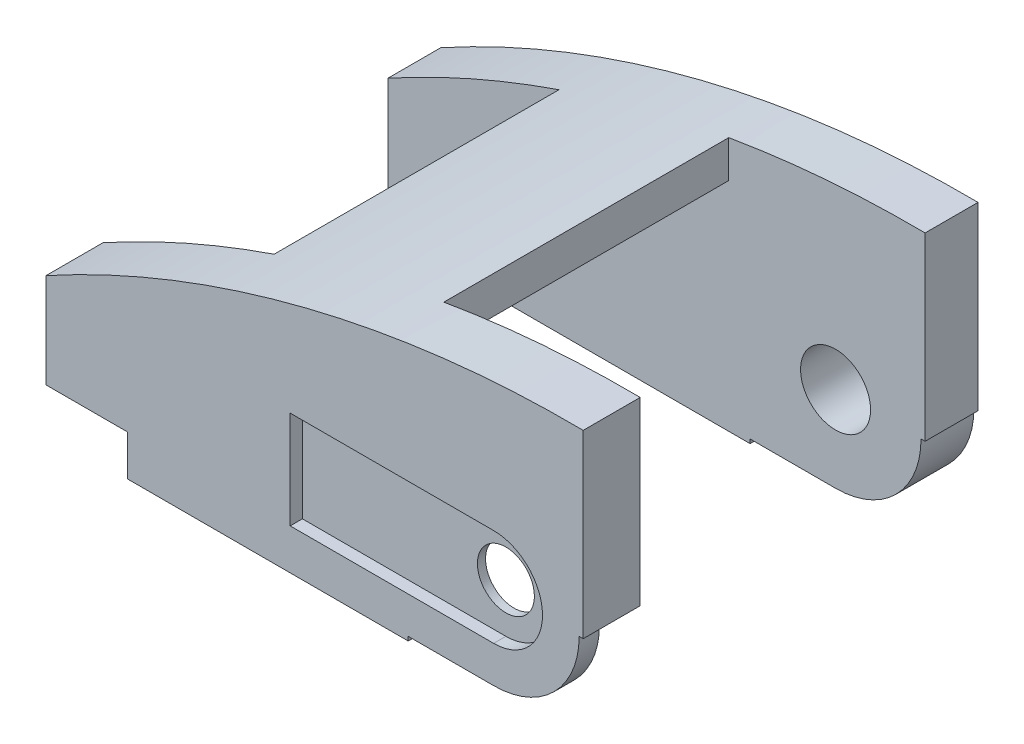
ISO-10303-21;
HEADER;
FILE_DESCRIPTION(('STEP AP214'),'2;1');
FILE_NAME('part.step','',(''),(''),'','','');
FILE_SCHEMA(('AUTOMOTIVE_DESIGN { 1 0 10303 214 1 1 1 1 }'));
ENDSEC;
DATA;
#1=APPLICATION_CONTEXT('core data for automotive mechanical design processes');
#2=APPLICATION_PROTOCOL_DEFINITION('international standard','automotive_design',2000,#1);
#3=PRODUCT_CONTEXT('',#1,'mechanical');
#4=PRODUCT('Part','Part','',(#3));
#5=PRODUCT_RELATED_PRODUCT_CATEGORY('part','',(#4));
#6=PRODUCT_DEFINITION_FORMATION('','',#4);
#7=PRODUCT_DEFINITION_CONTEXT('part definition',#1,'design');
#8=PRODUCT_DEFINITION('design','',#6,#7);
#9=PRODUCT_DEFINITION_SHAPE('','',#8);
#10=(LENGTH_UNIT() NAMED_UNIT(*) SI_UNIT(.MILLI.,.METRE.));
#11=(NAMED_UNIT(*) PLANE_ANGLE_UNIT() SI_UNIT($,.RADIAN.));
#12=(NAMED_UNIT(*) SI_UNIT($,.STERADIAN.) SOLID_ANGLE_UNIT());
#13=UNCERTAINTY_MEASURE_WITH_UNIT(LENGTH_MEASURE(1.E-05),#10,'distance_accuracy_value','');
#14=(GEOMETRIC_REPRESENTATION_CONTEXT(3) GLOBAL_UNCERTAINTY_ASSIGNED_CONTEXT((#13)) GLOBAL_UNIT_ASSIGNED_CONTEXT((#10,
#11,#12)) REPRESENTATION_CONTEXT('',''));
#15=CARTESIAN_POINT('',(0.,0.,0.));
#16=DIRECTION('',(0.,0.,1.));
#17=DIRECTION('',(1.,0.,0.));
#18=AXIS2_PLACEMENT_3D('',#15,#16,#17);
#19=CARTESIAN_POINT('',(0.,0.,0.));
#20=DIRECTION('',(0.,0.,1.));
#21=DIRECTION('',(1.,0.,0.));
#22=AXIS2_PLACEMENT_3D('',#19,#20,#21);
#23=PLANE('',#22);
#24=DIRECTION('',(0.,-1.,0.));
#25=VECTOR('',#24,1.);
#26=CARTESIAN_POINT('',(-10.5,0.,0.));
#27=LINE('',#26,#25);
#28=CARTESIAN_POINT('',(-10.5,-10.5,0.));
#29=VERTEX_POINT('',#28);
#30=CARTESIAN_POINT('',(-10.5,-11.,0.));
#31=VERTEX_POINT('',#30);
#32=EDGE_CURVE('E339',#29,#31,#27,.T.);
#33=ORIENTED_EDGE('',*,*,#32,.F.);
#34=DIRECTION('',(-1.,0.,0.));
#35=VECTOR('',#34,1.);
#36=CARTESIAN_POINT('',(0.,-10.5,0.));
#37=LINE('',#36,#35);
#38=CARTESIAN_POINT('',(1.09981662173559E-13,-10.5,0.));
#39=VERTEX_POINT('',#38);
#40=EDGE_CURVE('E359',#39,#29,#37,.T.);
#41=ORIENTED_EDGE('',*,*,#40,.F.);
#42=CARTESIAN_POINT('',(0.,0.,0.));
#43=DIRECTION('',(0.,0.,1.));
#44=DIRECTION('',(1.,0.,0.));
#45=AXIS2_PLACEMENT_3D('',#42,#43,#44);
#46=CIRCLE('',#45,10.5);
#47=CARTESIAN_POINT('',(10.5,0.,0.));
#48=VERTEX_POINT('',#47);
#49=EDGE_CURVE('E355',#39,#48,#46,.T.);
#50=ORIENTED_EDGE('',*,*,#49,.T.);
#51=DIRECTION('',(1.,0.,0.));
#52=VECTOR('',#51,1.);
#53=CARTESIAN_POINT('',(0.,0.,0.));
#54=LINE('',#53,#52);
#55=CARTESIAN_POINT('',(11.,0.,0.));
#56=VERTEX_POINT('',#55);
#57=EDGE_CURVE('E351',#48,#56,#54,.T.);
#58=ORIENTED_EDGE('',*,*,#57,.T.);
#59=DIRECTION('',(0.,-1.,0.));
#60=VECTOR('',#59,1.);
#61=CARTESIAN_POINT('',(11.,0.,0.));
#62=LINE('',#61,#60);
#63=CARTESIAN_POINT('',(11.,22.17,0.));
#64=VERTEX_POINT('',#63);
#65=EDGE_CURVE('E525',#64,#56,#62,.T.);
#66=ORIENTED_EDGE('',*,*,#65,.F.);
#67=CARTESIAN_POINT('',(9.5633033025968,-112.038627084912,0.));
#68=DIRECTION('',(0.,0.,1.));
#69=DIRECTION('',(1.,0.,0.));
#70=AXIS2_PLACEMENT_3D('',#67,#68,#69);
#71=CIRCLE('',#70,134.216316748067);
#72=CARTESIAN_POINT('',(-55.,5.62869866048854,0.));
#73=VERTEX_POINT('',#72);
#74=EDGE_CURVE('E469',#64,#73,#71,.T.);
#75=ORIENTED_EDGE('',*,*,#74,.T.);
#76=DIRECTION('',(0.,1.,0.));
#77=VECTOR('',#76,1.);
#78=CARTESIAN_POINT('',(-55.,0.,0.));
#79=LINE('',#78,#77);
#80=CARTESIAN_POINT('',(-55.,-6.,0.));
#81=VERTEX_POINT('',#80);
#82=EDGE_CURVE('E504',#81,#73,#79,.T.);
#83=ORIENTED_EDGE('',*,*,#82,.F.);
#84=DIRECTION('',(1.,0.,0.));
#85=VECTOR('',#84,1.);
#86=CARTESIAN_POINT('',(-55.,-6.,0.));
#87=LINE('',#86,#85);
#88=CARTESIAN_POINT('',(-45.,-6.00000000000001,0.));
#89=VERTEX_POINT('',#88);
#90=EDGE_CURVE('E474',#81,#89,#87,.T.);
#91=ORIENTED_EDGE('',*,*,#90,.T.);
#92=DIRECTION('',(0.,-1.,0.));
#93=VECTOR('',#92,1.);
#94=CARTESIAN_POINT('',(-45.,-11.,0.));
#95=LINE('',#94,#93);
#96=CARTESIAN_POINT('',(-45.,-11.,0.));
#97=VERTEX_POINT('',#96);
#98=EDGE_CURVE('E478',#89,#97,#95,.T.);
#99=ORIENTED_EDGE('',*,*,#98,.T.);
#100=DIRECTION('',(-1.,0.,0.));
#101=VECTOR('',#100,1.);
#102=CARTESIAN_POINT('',(0.,-11.,0.));
#103=LINE('',#102,#101);
#104=EDGE_CURVE('E521',#31,#97,#103,.T.);
#105=ORIENTED_EDGE('',*,*,#104,.F.);
#106=EDGE_LOOP('',(#33,#41,#50,#58,#66,#75,#83,#91,#99,#105));
#107=FACE_BOUND('',#106,.T.);
#108=CARTESIAN_POINT('',(0.,0.,0.));
#109=DIRECTION('',(0.,0.,1.));
#110=DIRECTION('',(1.,0.,0.));
#111=AXIS2_PLACEMENT_3D('',#108,#109,#110);
#112=CIRCLE('',#111,6.);
#113=CARTESIAN_POINT('',(0.,-6.,0.));
#114=VERTEX_POINT('',#113);
#115=CARTESIAN_POINT('',(0.,6.,0.));
#116=VERTEX_POINT('',#115);
#117=EDGE_CURVE('E286',#114,#116,#112,.T.);
#118=ORIENTED_EDGE('',*,*,#117,.F.);
#119=DIRECTION('',(-1.,0.,0.));
#120=VECTOR('',#119,1.);
#121=CARTESIAN_POINT('',(0.,-6.,0.));
#122=LINE('',#121,#120);
#123=CARTESIAN_POINT('',(-25.,-6.,0.));
#124=VERTEX_POINT('',#123);
#125=EDGE_CURVE('E65',#114,#124,#122,.T.);
#126=ORIENTED_EDGE('',*,*,#125,.T.);
#127=DIRECTION('',(0.,-1.,0.));
#128=VECTOR('',#127,1.);
#129=CARTESIAN_POINT('',(-25.,0.,0.));
#130=LINE('',#129,#128);
#131=CARTESIAN_POINT('',(-25.,6.,0.));
#132=VERTEX_POINT('',#131);
#133=EDGE_CURVE('E293',#132,#124,#130,.T.);
#134=ORIENTED_EDGE('',*,*,#133,.F.);
#135=DIRECTION('',(-1.,0.,0.));
#136=VECTOR('',#135,1.);
#137=CARTESIAN_POINT('',(0.,6.,0.));
#138=LINE('',#137,#136);
#139=EDGE_CURVE('E289',#116,#132,#138,.T.);
#140=ORIENTED_EDGE('',*,*,#139,.F.);
#141=EDGE_LOOP('',(#118,#126,#134,#140));
#142=FACE_BOUND('',#141,.T.);
#143=ADVANCED_FACE('F47',(#107,#142),#23,.T.);
#144=CARTESIAN_POINT('',(0.,0.,-21.75));
#145=DIRECTION('',(0.,0.,1.));
#146=DIRECTION('',(1.,0.,0.));
#147=AXIS2_PLACEMENT_3D('',#144,#145,#146);
#148=CYLINDRICAL_SURFACE('',#147,3.5);
#149=CARTESIAN_POINT('',(0.,0.,-2.5));
#150=DIRECTION('',(0.,0.,-1.));
#151=DIRECTION('',(0.,1.,0.));
#152=AXIS2_PLACEMENT_3D('',#149,#150,#151);
#153=CIRCLE('',#152,3.5);
#154=CARTESIAN_POINT('',(0.,3.5,-2.5));
#155=VERTEX_POINT('',#154);
#156=EDGE_CURVE('E51',#155,#155,#153,.T.);
#157=ORIENTED_EDGE('',*,*,#156,.T.);
#158=EDGE_LOOP('',(#157));
#159=FACE_BOUND('',#158,.T.);
#160=CARTESIAN_POINT('',(0.,0.,-1.5));
#161=DIRECTION('',(0.,0.,1.));
#162=DIRECTION('',(1.,0.,0.));
#163=AXIS2_PLACEMENT_3D('',#160,#161,#162);
#164=CIRCLE('',#163,3.5);
#165=CARTESIAN_POINT('',(3.5,0.,-1.5));
#166=VERTEX_POINT('',#165);
#167=EDGE_CURVE('E271',#166,#166,#164,.F.);
#168=ORIENTED_EDGE('',*,*,#167,.F.);
#169=EDGE_LOOP('',(#168));
#170=FACE_BOUND('',#169,.T.);
#171=ADVANCED_FACE('F647',(#159,#170),#148,.F.);
#172=CARTESIAN_POINT('',(0.,-10.5,-48.5));
#173=DIRECTION('',(0.,1.,0.));
#174=DIRECTION('',(0.,0.,1.));
#175=AXIS2_PLACEMENT_3D('',#172,#173,#174);
#176=PLANE('',#175);
#177=DIRECTION('',(0.,0.,-1.));
#178=VECTOR('',#177,1.);
#179=CARTESIAN_POINT('',(-9.5,-10.5,-2.5));
#180=LINE('',#179,#178);
#181=CARTESIAN_POINT('',(-9.5,-10.5,-2.5));
#182=VERTEX_POINT('',#181);
#183=CARTESIAN_POINT('',(-9.5,-10.5,-7.00000000000001));
#184=VERTEX_POINT('',#183);
#185=EDGE_CURVE('E316',#182,#184,#180,.T.);
#186=ORIENTED_EDGE('',*,*,#185,.F.);
#187=DIRECTION('',(-1.,0.,0.));
#188=VECTOR('',#187,1.);
#189=CARTESIAN_POINT('',(0.,-10.5,-2.5));
#190=LINE('',#189,#188);
#191=CARTESIAN_POINT('',(1.09981662173559E-13,-10.5,-2.50000000000002));
#192=VERTEX_POINT('',#191);
#193=EDGE_CURVE('E305',#192,#182,#190,.T.);
#194=ORIENTED_EDGE('',*,*,#193,.F.);
#195=DIRECTION('',(0.,0.,1.));
#196=VECTOR('',#195,1.);
#197=CARTESIAN_POINT('',(1.09981662173559E-13,-10.5,-48.5));
#198=LINE('',#197,#196);
#199=EDGE_CURVE('E380',#192,#39,#198,.T.);
#200=ORIENTED_EDGE('',*,*,#199,.T.);
#201=ORIENTED_EDGE('',*,*,#40,.T.);
#202=DIRECTION('',(0.,0.,1.));
#203=VECTOR('',#202,1.);
#204=CARTESIAN_POINT('',(-10.5,-10.5,-48.5));
#205=LINE('',#204,#203);
#206=CARTESIAN_POINT('',(-10.5,-10.5,-7.00000000000001));
#207=VERTEX_POINT('',#206);
#208=EDGE_CURVE('E375',#207,#29,#205,.T.);
#209=ORIENTED_EDGE('',*,*,#208,.F.);
#210=DIRECTION('',(-1.,0.,0.));
#211=VECTOR('',#210,1.);
#212=CARTESIAN_POINT('',(12.,-10.5,-7.));
#213=LINE('',#212,#211);
#214=EDGE_CURVE('E398',#184,#207,#213,.T.);
#215=ORIENTED_EDGE('',*,*,#214,.F.);
#216=EDGE_LOOP('',(#186,#194,#200,#201,#209,#215));
#217=FACE_BOUND('',#216,.T.);
#218=ADVANCED_FACE('F637',(#217),#176,.F.);
#219=CARTESIAN_POINT('',(11.,0.,-48.5));
#220=DIRECTION('',(-1.,0.,0.));
#221=DIRECTION('',(0.,0.,1.));
#222=AXIS2_PLACEMENT_3D('',#219,#220,#221);
#223=PLANE('',#222);
#224=DIRECTION('',(0.,0.,-1.));
#225=VECTOR('',#224,1.);
#226=CARTESIAN_POINT('',(11.,22.17,1.75000000000001));
#227=LINE('',#226,#225);
#228=CARTESIAN_POINT('',(11.,22.17,-42.));
#229=VERTEX_POINT('',#228);
#230=CARTESIAN_POINT('',(11.,22.17,-48.5));
#231=VERTEX_POINT('',#230);
#232=EDGE_CURVE('E460',#229,#231,#227,.T.);
#233=ORIENTED_EDGE('',*,*,#232,.F.);
#234=DIRECTION('',(0.,1.,0.));
#235=VECTOR('',#234,1.);
#236=CARTESIAN_POINT('',(11.,0.,-42.));
#237=LINE('',#236,#235);
#238=CARTESIAN_POINT('',(11.,0.,-42.));
#239=VERTEX_POINT('',#238);
#240=EDGE_CURVE('E508',#239,#229,#237,.T.);
#241=ORIENTED_EDGE('',*,*,#240,.F.);
#242=DIRECTION('',(0.,0.,1.));
#243=VECTOR('',#242,1.);
#244=CARTESIAN_POINT('',(11.,0.,-48.5));
#245=LINE('',#244,#243);
#246=CARTESIAN_POINT('',(11.,0.,-48.5));
#247=VERTEX_POINT('',#246);
#248=EDGE_CURVE('E536',#247,#239,#245,.T.);
#249=ORIENTED_EDGE('',*,*,#248,.F.);
#250=DIRECTION('',(0.,-1.,0.));
#251=VECTOR('',#250,1.);
#252=CARTESIAN_POINT('',(11.,0.,-48.5));
#253=LINE('',#252,#251);
#254=EDGE_CURVE('E528',#231,#247,#253,.T.);
#255=ORIENTED_EDGE('',*,*,#254,.F.);
#256=EDGE_LOOP('',(#233,#241,#249,#255));
#257=FACE_BOUND('',#256,.T.);
#258=ADVANCED_FACE('F624',(#257),#223,.F.);
#259=CARTESIAN_POINT('',(-55.,0.,0.));
#260=DIRECTION('',(-1.,0.,0.));
#261=DIRECTION('',(0.,-1.,0.));
#262=AXIS2_PLACEMENT_3D('',#259,#260,#261);
#263=PLANE('',#262);
#264=DIRECTION('',(0.,0.,-1.));
#265=VECTOR('',#264,1.);
#266=CARTESIAN_POINT('',(-55.,5.62869866048853,1.75000000000001));
#267=LINE('',#266,#265);
#268=CARTESIAN_POINT('',(-55.,5.62869866048854,-7.));
#269=VERTEX_POINT('',#268);
#270=EDGE_CURVE('E561',#73,#269,#267,.T.);
#271=ORIENTED_EDGE('',*,*,#270,.T.);
#272=DIRECTION('',(0.,-1.,0.));
#273=VECTOR('',#272,1.);
#274=CARTESIAN_POINT('',(-55.,0.,-7.));
#275=LINE('',#274,#273);
#276=CARTESIAN_POINT('',(-55.,-6.,-7.));
#277=VERTEX_POINT('',#276);
#278=EDGE_CURVE('E440',#269,#277,#275,.T.);
#279=ORIENTED_EDGE('',*,*,#278,.T.);
#280=DIRECTION('',(0.,0.,-1.));
#281=VECTOR('',#280,1.);
#282=CARTESIAN_POINT('',(-55.,-6.,0.));
#283=LINE('',#282,#281);
#284=EDGE_CURVE('E552',#81,#277,#283,.T.);
#285=ORIENTED_EDGE('',*,*,#284,.F.);
#286=ORIENTED_EDGE('',*,*,#82,.T.);
#287=EDGE_LOOP('',(#271,#279,#285,#286));
#288=FACE_BOUND('',#287,.T.);
#289=ADVANCED_FACE('F708',(#288),#263,.T.);
#290=CARTESIAN_POINT('',(-55.,-6.,0.));
#291=DIRECTION('',(0.,1.,0.));
#292=DIRECTION('',(-1.,0.,0.));
#293=AXIS2_PLACEMENT_3D('',#290,#291,#292);
#294=PLANE('',#293);
#295=DIRECTION('',(-1.,0.,0.));
#296=VECTOR('',#295,1.);
#297=CARTESIAN_POINT('',(-55.,-6.,-7.));
#298=LINE('',#297,#296);
#299=CARTESIAN_POINT('',(-45.,-6.00000000000001,-7.));
#300=VERTEX_POINT('',#299);
#301=EDGE_CURVE('E437',#300,#277,#298,.T.);
#302=ORIENTED_EDGE('',*,*,#301,.F.);
#303=DIRECTION('',(0.,0.,-1.));
#304=VECTOR('',#303,1.);
#305=CARTESIAN_POINT('',(-45.,-6.00000000000001,0.));
#306=LINE('',#305,#304);
#307=EDGE_CURVE('E496',#89,#300,#306,.T.);
#308=ORIENTED_EDGE('',*,*,#307,.F.);
#309=ORIENTED_EDGE('',*,*,#90,.F.);
#310=ORIENTED_EDGE('',*,*,#284,.T.);
#311=EDGE_LOOP('',(#302,#308,#309,#310));
#312=FACE_BOUND('',#311,.T.);
#313=ADVANCED_FACE('F711',(#312),#294,.F.);
#314=CARTESIAN_POINT('',(9.5633033025968,-112.038627084912,1.75000000000001));
#315=DIRECTION('',(0.,0.,-1.));
#316=DIRECTION('',(-1.,0.,0.));
#317=AXIS2_PLACEMENT_3D('',#314,#315,#316);
#318=CYLINDRICAL_SURFACE('',#317,134.216316748067);
#319=DIRECTION('',(0.,0.,-1.));
#320=VECTOR('',#319,1.);
#321=CARTESIAN_POINT('',(-33.9746631160101,14.9198903983571,1.75000000000001));
#322=LINE('',#321,#320);
#323=CARTESIAN_POINT('',(-33.9746631160101,14.9198903983572,-42.));
#324=VERTEX_POINT('',#323);
#325=CARTESIAN_POINT('',(-33.9746631160101,14.9198903983572,-7.));
#326=VERTEX_POINT('',#325);
#327=EDGE_CURVE('E448',#324,#326,#322,.F.);
#328=ORIENTED_EDGE('',*,*,#327,.T.);
#329=CARTESIAN_POINT('',(9.5633033025968,-112.038627084912,-7.));
#330=DIRECTION('',(0.,0.,-1.));
#331=DIRECTION('',(-1.,0.,0.));
#332=AXIS2_PLACEMENT_3D('',#329,#330,#331);
#333=CIRCLE('',#332,134.216316748067);
#334=EDGE_CURVE('E444',#326,#269,#333,.F.);
#335=ORIENTED_EDGE('',*,*,#334,.T.);
#336=ORIENTED_EDGE('',*,*,#270,.F.);
#337=ORIENTED_EDGE('',*,*,#74,.F.);
#338=CARTESIAN_POINT('',(11.,22.17,-7.));
#339=VERTEX_POINT('',#338);
#340=EDGE_CURVE('E461',#64,#339,#227,.T.);
#341=ORIENTED_EDGE('',*,*,#340,.T.);
#342=CARTESIAN_POINT('',(9.5633033025968,-112.038627084912,-7.));
#343=DIRECTION('',(0.,0.,1.));
#344=DIRECTION('',(1.,0.,0.));
#345=AXIS2_PLACEMENT_3D('',#342,#343,#344);
#346=CIRCLE('',#345,134.216316748067);
#347=CARTESIAN_POINT('',(-13.1228451764224,20.2465132317736,-7.));
#348=VERTEX_POINT('',#347);
#349=EDGE_CURVE('E419',#348,#339,#346,.F.);
#350=ORIENTED_EDGE('',*,*,#349,.F.);
#351=DIRECTION('',(0.,0.,-1.));
#352=VECTOR('',#351,1.);
#353=CARTESIAN_POINT('',(-13.1228451764224,20.2465132317736,1.75000000000001));
#354=LINE('',#353,#352);
#355=CARTESIAN_POINT('',(-13.1228451764224,20.2465132317736,-42.));
#356=VERTEX_POINT('',#355);
#357=EDGE_CURVE('E423',#348,#356,#354,.T.);
#358=ORIENTED_EDGE('',*,*,#357,.T.);
#359=CARTESIAN_POINT('',(9.5633033025968,-112.038627084912,-42.));
#360=DIRECTION('',(0.,0.,1.));
#361=DIRECTION('',(1.,0.,0.));
#362=AXIS2_PLACEMENT_3D('',#359,#360,#361);
#363=CIRCLE('',#362,134.216316748067);
#364=EDGE_CURVE('E411',#356,#229,#363,.F.);
#365=ORIENTED_EDGE('',*,*,#364,.T.);
#366=ORIENTED_EDGE('',*,*,#232,.T.);
#367=CARTESIAN_POINT('',(9.5633033025968,-112.038627084912,-48.5));
#368=DIRECTION('',(0.,0.,-1.));
#369=DIRECTION('',(-1.,0.,0.));
#370=AXIS2_PLACEMENT_3D('',#367,#368,#369);
#371=CIRCLE('',#370,134.216316748067);
#372=CARTESIAN_POINT('',(-55.,5.62869866048853,-48.5));
#373=VERTEX_POINT('',#372);
#374=EDGE_CURVE('E465',#373,#231,#371,.T.);
#375=ORIENTED_EDGE('',*,*,#374,.F.);
#376=CARTESIAN_POINT('',(-55.,5.62869866048854,-42.));
#377=VERTEX_POINT('',#376);
#378=EDGE_CURVE('E560',#377,#373,#267,.T.);
#379=ORIENTED_EDGE('',*,*,#378,.F.);
#380=CARTESIAN_POINT('',(9.5633033025968,-112.038627084912,-42.));
#381=DIRECTION('',(0.,0.,-1.));
#382=DIRECTION('',(-1.,0.,0.));
#383=AXIS2_PLACEMENT_3D('',#380,#381,#382);
#384=CIRCLE('',#383,134.216316748067);
#385=EDGE_CURVE('E434',#324,#377,#384,.F.);
#386=ORIENTED_EDGE('',*,*,#385,.F.);
#387=EDGE_LOOP('',(#328,#335,#336,#337,#341,#350,#358,#365,#366,#375,#379,#386));
#388=FACE_BOUND('',#387,.T.);
#389=ADVANCED_FACE('F618',(#388),#318,.T.);
#390=CARTESIAN_POINT('',(-8.45749999999999,-25.4575,-44.25));
#391=DIRECTION('',(0.,0.,1.));
#392=DIRECTION('',(1.,0.,0.));
#393=AXIS2_PLACEMENT_3D('',#390,#391,#392);
#394=CYLINDRICAL_SURFACE('',#393,41.3998624695783);
#395=CARTESIAN_POINT('',(-8.45749999999999,-25.4575,-7.));
#396=DIRECTION('',(0.,0.,1.));
#397=DIRECTION('',(0.,-1.,0.));
#398=AXIS2_PLACEMENT_3D('',#395,#396,#397);
#399=CIRCLE('',#398,41.3998624695783);
#400=CARTESIAN_POINT('',(-33.9746631160101,7.14346622817998,-7.));
#401=VERTEX_POINT('',#400);
#402=CARTESIAN_POINT('',(-13.1228451764224,15.678654011828,-7.));
#403=VERTEX_POINT('',#402);
#404=EDGE_CURVE('E456',#401,#403,#399,.F.);
#405=ORIENTED_EDGE('',*,*,#404,.F.);
#406=DIRECTION('',(0.,0.,1.));
#407=VECTOR('',#406,1.);
#408=CARTESIAN_POINT('',(-33.9746631160101,7.14346622817998,-44.25));
#409=LINE('',#408,#407);
#410=CARTESIAN_POINT('',(-33.9746631160101,7.14346622817998,-42.));
#411=VERTEX_POINT('',#410);
#412=EDGE_CURVE('E569',#401,#411,#409,.F.);
#413=ORIENTED_EDGE('',*,*,#412,.T.);
#414=CARTESIAN_POINT('',(-8.45749999999999,-25.4575,-42.));
#415=DIRECTION('',(0.,0.,1.));
#416=DIRECTION('',(1.,0.,0.));
#417=AXIS2_PLACEMENT_3D('',#414,#415,#416);
#418=CIRCLE('',#417,41.3998624695783);
#419=CARTESIAN_POINT('',(-13.1228451764224,15.678654011828,-42.));
#420=VERTEX_POINT('',#419);
#421=EDGE_CURVE('E452',#411,#420,#418,.F.);
#422=ORIENTED_EDGE('',*,*,#421,.T.);
#423=DIRECTION('',(0.,0.,1.));
#424=VECTOR('',#423,1.);
#425=CARTESIAN_POINT('',(-13.1228451764224,15.678654011828,-44.25));
#426=LINE('',#425,#424);
#427=EDGE_CURVE('E565',#420,#403,#426,.T.);
#428=ORIENTED_EDGE('',*,*,#427,.T.);
#429=EDGE_LOOP('',(#405,#413,#422,#428));
#430=FACE_BOUND('',#429,.T.);
#431=ADVANCED_FACE('F665',(#430),#394,.F.);
#432=CARTESIAN_POINT('',(12.,-12.,-7.));
#433=DIRECTION('',(0.,0.,1.));
#434=DIRECTION('',(0.,-1.,0.));
#435=AXIS2_PLACEMENT_3D('',#432,#433,#434);
#436=PLANE('',#435);
#437=DIRECTION('',(1.,0.,0.));
#438=VECTOR('',#437,1.);
#439=CARTESIAN_POINT('',(12.,0.,-7.));
#440=LINE('',#439,#438);
#441=CARTESIAN_POINT('',(9.5,0.,-7.));
#442=VERTEX_POINT('',#441);
#443=CARTESIAN_POINT('',(11.,0.,-7.00000000000001));
#444=VERTEX_POINT('',#443);
#445=EDGE_CURVE('E388',#442,#444,#440,.T.);
#446=ORIENTED_EDGE('',*,*,#445,.F.);
#447=CARTESIAN_POINT('',(0.,0.,-7.));
#448=DIRECTION('',(0.,0.,-1.));
#449=DIRECTION('',(0.,1.,0.));
#450=AXIS2_PLACEMENT_3D('',#447,#448,#449);
#451=CIRCLE('',#450,9.5);
#452=CARTESIAN_POINT('',(-9.5,0.,-7.));
#453=VERTEX_POINT('',#452);
#454=EDGE_CURVE('E544',#453,#442,#451,.T.);
#455=ORIENTED_EDGE('',*,*,#454,.F.);
#456=DIRECTION('',(0.,1.,0.));
#457=VECTOR('',#456,1.);
#458=CARTESIAN_POINT('',(-9.5,-12.,-7.));
#459=LINE('',#458,#457);
#460=EDGE_CURVE('E327',#184,#453,#459,.T.);
#461=ORIENTED_EDGE('',*,*,#460,.F.);
#462=ORIENTED_EDGE('',*,*,#214,.T.);
#463=DIRECTION('',(0.,-1.,0.));
#464=VECTOR('',#463,1.);
#465=CARTESIAN_POINT('',(-10.5,-12.,-7.));
#466=LINE('',#465,#464);
#467=CARTESIAN_POINT('',(-10.5,-11.,-7.00000000000001));
#468=VERTEX_POINT('',#467);
#469=EDGE_CURVE('E394',#207,#468,#466,.T.);
#470=ORIENTED_EDGE('',*,*,#469,.T.);
#471=DIRECTION('',(-1.,0.,0.));
#472=VECTOR('',#471,1.);
#473=CARTESIAN_POINT('',(0.,-11.,-7.));
#474=LINE('',#473,#472);
#475=CARTESIAN_POINT('',(-45.,-11.,-6.99999999999999));
#476=VERTEX_POINT('',#475);
#477=EDGE_CURVE('E522',#468,#476,#474,.T.);
#478=ORIENTED_EDGE('',*,*,#477,.T.);
#479=DIRECTION('',(0.,1.,0.));
#480=VECTOR('',#479,1.);
#481=CARTESIAN_POINT('',(-45.,-12.,-7.));
#482=LINE('',#481,#480);
#483=EDGE_CURVE('E494',#476,#300,#482,.T.);
#484=ORIENTED_EDGE('',*,*,#483,.T.);
#485=ORIENTED_EDGE('',*,*,#301,.T.);
#486=ORIENTED_EDGE('',*,*,#278,.F.);
#487=ORIENTED_EDGE('',*,*,#334,.F.);
#488=DIRECTION('',(0.,1.,0.));
#489=VECTOR('',#488,1.);
#490=CARTESIAN_POINT('',(-33.9746631160101,19.6003459082393,-7.));
#491=LINE('',#490,#489);
#492=EDGE_CURVE('E406',#401,#326,#491,.T.);
#493=ORIENTED_EDGE('',*,*,#492,.F.);
#494=ORIENTED_EDGE('',*,*,#404,.T.);
#495=DIRECTION('',(0.,-1.,0.));
#496=VECTOR('',#495,1.);
#497=CARTESIAN_POINT('',(-13.1228451764224,24.9751933895616,-7.));
#498=LINE('',#497,#496);
#499=EDGE_CURVE('E401',#348,#403,#498,.T.);
#500=ORIENTED_EDGE('',*,*,#499,.F.);
#501=ORIENTED_EDGE('',*,*,#349,.T.);
#502=DIRECTION('',(0.,-1.,0.));
#503=VECTOR('',#502,1.);
#504=CARTESIAN_POINT('',(11.,-12.,-7.));
#505=LINE('',#504,#503);
#506=EDGE_CURVE('E539',#339,#444,#505,.T.);
#507=ORIENTED_EDGE('',*,*,#506,.T.);
#508=EDGE_LOOP('',(#446,#455,#461,#462,#470,#478,#484,#485,#486,#487,#493,#494,#500,#501,#507));
#509=FACE_BOUND('',#508,.T.);
#510=ADVANCED_FACE('F663',(#509),#436,.F.);
#511=CARTESIAN_POINT('',(0.,0.,-48.5));
#512=DIRECTION('',(0.,0.,-1.));
#513=DIRECTION('',(-1.,0.,0.));
#514=AXIS2_PLACEMENT_3D('',#511,#512,#513);
#515=PLANE('',#514);
#516=CARTESIAN_POINT('',(0.,0.,-48.5));
#517=DIRECTION('',(0.,0.,1.));
#518=DIRECTION('',(1.,0.,0.));
#519=AXIS2_PLACEMENT_3D('',#516,#517,#518);
#520=CIRCLE('',#519,4.3);
#521=CARTESIAN_POINT('',(4.3,0.,-48.5));
#522=VERTEX_POINT('',#521);
#523=EDGE_CURVE('E330',#522,#522,#520,.T.);
#524=ORIENTED_EDGE('',*,*,#523,.T.);
#525=EDGE_LOOP('',(#524));
#526=FACE_BOUND('',#525,.T.);
#527=DIRECTION('',(0.,-1.,0.));
#528=VECTOR('',#527,1.);
#529=CARTESIAN_POINT('',(-10.5,0.,-48.5));
#530=LINE('',#529,#528);
#531=CARTESIAN_POINT('',(-10.5,-10.5,-48.5));
#532=VERTEX_POINT('',#531);
#533=CARTESIAN_POINT('',(-10.5,-11.,-48.5));
#534=VERTEX_POINT('',#533);
#535=EDGE_CURVE('E346',#532,#534,#530,.T.);
#536=ORIENTED_EDGE('',*,*,#535,.T.);
#537=DIRECTION('',(-1.,0.,0.));
#538=VECTOR('',#537,1.);
#539=CARTESIAN_POINT('',(0.,-11.,-48.5));
#540=LINE('',#539,#538);
#541=CARTESIAN_POINT('',(-45.,-11.,-48.5));
#542=VERTEX_POINT('',#541);
#543=EDGE_CURVE('E518',#534,#542,#540,.T.);
#544=ORIENTED_EDGE('',*,*,#543,.T.);
#545=DIRECTION('',(0.,-1.,0.));
#546=VECTOR('',#545,1.);
#547=CARTESIAN_POINT('',(-45.,-11.,-48.5));
#548=LINE('',#547,#546);
#549=CARTESIAN_POINT('',(-45.,-6.00000000000001,-48.5));
#550=VERTEX_POINT('',#549);
#551=EDGE_CURVE('E479',#550,#542,#548,.T.);
#552=ORIENTED_EDGE('',*,*,#551,.F.);
#553=DIRECTION('',(1.,0.,0.));
#554=VECTOR('',#553,1.);
#555=CARTESIAN_POINT('',(-55.,-6.,-48.5));
#556=LINE('',#555,#554);
#557=CARTESIAN_POINT('',(-55.,-6.,-48.5));
#558=VERTEX_POINT('',#557);
#559=EDGE_CURVE('E473',#558,#550,#556,.T.);
#560=ORIENTED_EDGE('',*,*,#559,.F.);
#561=DIRECTION('',(0.,1.,0.));
#562=VECTOR('',#561,1.);
#563=CARTESIAN_POINT('',(-55.,0.,-48.5));
#564=LINE('',#563,#562);
#565=EDGE_CURVE('E503',#558,#373,#564,.T.);
#566=ORIENTED_EDGE('',*,*,#565,.T.);
#567=ORIENTED_EDGE('',*,*,#374,.T.);
#568=ORIENTED_EDGE('',*,*,#254,.T.);
#569=DIRECTION('',(1.,0.,0.));
#570=VECTOR('',#569,1.);
#571=CARTESIAN_POINT('',(0.,0.,-48.5));
#572=LINE('',#571,#570);
#573=CARTESIAN_POINT('',(10.5,0.,-48.5));
#574=VERTEX_POINT('',#573);
#575=EDGE_CURVE('E335',#574,#247,#572,.T.);
#576=ORIENTED_EDGE('',*,*,#575,.F.);
#577=CARTESIAN_POINT('',(0.,0.,-48.5));
#578=DIRECTION('',(0.,0.,1.));
#579=DIRECTION('',(1.,0.,0.));
#580=AXIS2_PLACEMENT_3D('',#577,#578,#579);
#581=CIRCLE('',#580,10.5);
#582=CARTESIAN_POINT('',(1.09981662173559E-13,-10.5,-48.5));
#583=VERTEX_POINT('',#582);
#584=EDGE_CURVE('E338',#583,#574,#581,.T.);
#585=ORIENTED_EDGE('',*,*,#584,.F.);
#586=DIRECTION('',(-1.,0.,0.));
#587=VECTOR('',#586,1.);
#588=CARTESIAN_POINT('',(0.,-10.5,-48.5));
#589=LINE('',#588,#587);
#590=EDGE_CURVE('E342',#583,#532,#589,.T.);
#591=ORIENTED_EDGE('',*,*,#590,.T.);
#592=EDGE_LOOP('',(#536,#544,#552,#560,#566,#567,#568,#576,#585,#591));
#593=FACE_BOUND('',#592,.T.);
#594=ADVANCED_FACE('F586',(#526,#593),#515,.T.);
#595=CARTESIAN_POINT('',(0.,0.,-42.));
#596=DIRECTION('',(0.,0.,1.));
#597=DIRECTION('',(1.,0.,0.));
#598=AXIS2_PLACEMENT_3D('',#595,#596,#597);
#599=PLANE('',#598);
#600=CARTESIAN_POINT('',(0.,0.,-42.));
#601=DIRECTION('',(0.,0.,1.));
#602=DIRECTION('',(1.,0.,0.));
#603=AXIS2_PLACEMENT_3D('',#600,#601,#602);
#604=CIRCLE('',#603,4.3);
#605=CARTESIAN_POINT('',(4.3,0.,-42.));
#606=VERTEX_POINT('',#605);
#607=EDGE_CURVE('E334',#606,#606,#604,.T.);
#608=ORIENTED_EDGE('',*,*,#607,.F.);
#609=EDGE_LOOP('',(#608));
#610=FACE_BOUND('',#609,.T.);
#611=DIRECTION('',(0.,-1.,0.));
#612=VECTOR('',#611,1.);
#613=CARTESIAN_POINT('',(-10.5,0.,-42.));
#614=LINE('',#613,#612);
#615=CARTESIAN_POINT('',(-10.5,-10.5,-42.));
#616=VERTEX_POINT('',#615);
#617=CARTESIAN_POINT('',(-10.5,-11.,-42.));
#618=VERTEX_POINT('',#617);
#619=EDGE_CURVE('E391',#616,#618,#614,.T.);
#620=ORIENTED_EDGE('',*,*,#619,.F.);
#621=DIRECTION('',(-1.,0.,0.));
#622=VECTOR('',#621,1.);
#623=CARTESIAN_POINT('',(0.,-10.5,-42.));
#624=LINE('',#623,#622);
#625=CARTESIAN_POINT('',(1.09981662173559E-13,-10.5,-42.));
#626=VERTEX_POINT('',#625);
#627=EDGE_CURVE('E11',#626,#616,#624,.T.);
#628=ORIENTED_EDGE('',*,*,#627,.F.);
#629=CARTESIAN_POINT('',(0.,0.,-42.));
#630=DIRECTION('',(0.,0.,1.));
#631=DIRECTION('',(1.,0.,0.));
#632=AXIS2_PLACEMENT_3D('',#629,#630,#631);
#633=CIRCLE('',#632,10.5);
#634=CARTESIAN_POINT('',(10.5,0.,-42.));
#635=VERTEX_POINT('',#634);
#636=EDGE_CURVE('E57',#626,#635,#633,.T.);
#637=ORIENTED_EDGE('',*,*,#636,.T.);
#638=DIRECTION('',(1.,0.,0.));
#639=VECTOR('',#638,1.);
#640=CARTESIAN_POINT('',(0.,0.,-42.));
#641=LINE('',#640,#639);
#642=EDGE_CURVE('E369',#635,#239,#641,.T.);
#643=ORIENTED_EDGE('',*,*,#642,.T.);
#644=ORIENTED_EDGE('',*,*,#240,.T.);
#645=ORIENTED_EDGE('',*,*,#364,.F.);
#646=DIRECTION('',(0.,-1.,0.));
#647=VECTOR('',#646,1.);
#648=CARTESIAN_POINT('',(-13.1228451764224,24.9751933895616,-42.));
#649=LINE('',#648,#647);
#650=EDGE_CURVE('E407',#356,#420,#649,.T.);
#651=ORIENTED_EDGE('',*,*,#650,.T.);
#652=ORIENTED_EDGE('',*,*,#421,.F.);
#653=DIRECTION('',(0.,1.,0.));
#654=VECTOR('',#653,1.);
#655=CARTESIAN_POINT('',(-33.9746631160101,19.6003459082393,-42.));
#656=LINE('',#655,#654);
#657=EDGE_CURVE('E402',#411,#324,#656,.T.);
#658=ORIENTED_EDGE('',*,*,#657,.T.);
#659=ORIENTED_EDGE('',*,*,#385,.T.);
#660=DIRECTION('',(0.,-1.,0.));
#661=VECTOR('',#660,1.);
#662=CARTESIAN_POINT('',(-55.,0.,-42.));
#663=LINE('',#662,#661);
#664=CARTESIAN_POINT('',(-55.,-6.,-42.));
#665=VERTEX_POINT('',#664);
#666=EDGE_CURVE('E431',#377,#665,#663,.T.);
#667=ORIENTED_EDGE('',*,*,#666,.T.);
#668=DIRECTION('',(-1.,0.,0.));
#669=VECTOR('',#668,1.);
#670=CARTESIAN_POINT('',(-55.,-6.,-42.));
#671=LINE('',#670,#669);
#672=CARTESIAN_POINT('',(-45.,-6.00000000000001,-42.));
#673=VERTEX_POINT('',#672);
#674=EDGE_CURVE('E427',#673,#665,#671,.T.);
#675=ORIENTED_EDGE('',*,*,#674,.F.);
#676=DIRECTION('',(0.,1.,0.));
#677=VECTOR('',#676,1.);
#678=CARTESIAN_POINT('',(-45.,0.,-42.));
#679=LINE('',#678,#677);
#680=CARTESIAN_POINT('',(-45.,-11.,-42.));
#681=VERTEX_POINT('',#680);
#682=EDGE_CURVE('E556',#681,#673,#679,.T.);
#683=ORIENTED_EDGE('',*,*,#682,.F.);
#684=DIRECTION('',(1.,0.,0.));
#685=VECTOR('',#684,1.);
#686=CARTESIAN_POINT('',(0.,-11.,-42.));
#687=LINE('',#686,#685);
#688=EDGE_CURVE('E514',#681,#618,#687,.T.);
#689=ORIENTED_EDGE('',*,*,#688,.T.);
#690=EDGE_LOOP('',(#620,#628,#637,#643,#644,#645,#651,#652,#658,#659,#667,#675,#683,#689));
#691=FACE_BOUND('',#690,.T.);
#692=ADVANCED_FACE('F582',(#610,#691),#599,.T.);
#693=ORIENTED_EDGE('',*,*,#506,.F.);
#694=ORIENTED_EDGE('',*,*,#340,.F.);
#695=ORIENTED_EDGE('',*,*,#65,.T.);
#696=EDGE_CURVE('E532',#444,#56,#245,.T.);
#697=ORIENTED_EDGE('',*,*,#696,.F.);
#698=EDGE_LOOP('',(#693,#694,#695,#697));
#699=FACE_BOUND('',#698,.T.);
#700=ADVANCED_FACE('F585',(#699),#223,.F.);
#701=ORIENTED_EDGE('',*,*,#666,.F.);
#702=ORIENTED_EDGE('',*,*,#378,.T.);
#703=ORIENTED_EDGE('',*,*,#565,.F.);
#704=EDGE_CURVE('E548',#665,#558,#283,.T.);
#705=ORIENTED_EDGE('',*,*,#704,.F.);
#706=EDGE_LOOP('',(#701,#702,#703,#705));
#707=FACE_BOUND('',#706,.T.);
#708=ADVANCED_FACE('F612',(#707),#263,.T.);
#709=CARTESIAN_POINT('',(0.,-11.,-7.));
#710=DIRECTION('',(0.,1.,0.));
#711=DIRECTION('',(-1.,0.,0.));
#712=AXIS2_PLACEMENT_3D('',#709,#710,#711);
#713=PLANE('',#712);
#714=ORIENTED_EDGE('',*,*,#543,.F.);
#715=DIRECTION('',(0.,0.,1.));
#716=VECTOR('',#715,1.);
#717=CARTESIAN_POINT('',(-10.5,-11.,-48.5));
#718=LINE('',#717,#716);
#719=EDGE_CURVE('E365',#534,#618,#718,.T.);
#720=ORIENTED_EDGE('',*,*,#719,.T.);
#721=ORIENTED_EDGE('',*,*,#688,.F.);
#722=DIRECTION('',(0.,0.,-1.));
#723=VECTOR('',#722,1.);
#724=CARTESIAN_POINT('',(-45.,-11.,0.));
#725=LINE('',#724,#723);
#726=EDGE_CURVE('E495',#681,#542,#725,.T.);
#727=ORIENTED_EDGE('',*,*,#726,.T.);
#728=EDGE_LOOP('',(#714,#720,#721,#727));
#729=FACE_BOUND('',#728,.T.);
#730=ADVANCED_FACE('F597',(#729),#713,.F.);
#731=ORIENTED_EDGE('',*,*,#477,.F.);
#732=EDGE_CURVE('E370',#468,#31,#718,.T.);
#733=ORIENTED_EDGE('',*,*,#732,.T.);
#734=ORIENTED_EDGE('',*,*,#104,.T.);
#735=EDGE_CURVE('E490',#97,#476,#725,.T.);
#736=ORIENTED_EDGE('',*,*,#735,.T.);
#737=EDGE_LOOP('',(#731,#733,#734,#736));
#738=FACE_BOUND('',#737,.T.);
#739=ADVANCED_FACE('F676',(#738),#713,.F.);
#740=CARTESIAN_POINT('',(0.,0.,-2.5));
#741=DIRECTION('',(0.,0.,-1.));
#742=DIRECTION('',(0.,1.,0.));
#743=AXIS2_PLACEMENT_3D('',#740,#741,#742);
#744=PLANE('',#743);
#745=ORIENTED_EDGE('',*,*,#156,.F.);
#746=EDGE_LOOP('',(#745));
#747=FACE_BOUND('',#746,.T.);
#748=CARTESIAN_POINT('',(0.,0.,-2.5));
#749=DIRECTION('',(0.,0.,-1.));
#750=DIRECTION('',(0.,1.,0.));
#751=AXIS2_PLACEMENT_3D('',#748,#749,#750);
#752=CIRCLE('',#751,9.5);
#753=CARTESIAN_POINT('',(-9.5,0.,-2.5));
#754=VERTEX_POINT('',#753);
#755=CARTESIAN_POINT('',(9.5,0.,-2.5));
#756=VERTEX_POINT('',#755);
#757=EDGE_CURVE('E543',#754,#756,#752,.T.);
#758=ORIENTED_EDGE('',*,*,#757,.T.);
#759=DIRECTION('',(1.,0.,0.));
#760=VECTOR('',#759,1.);
#761=CARTESIAN_POINT('',(0.,0.,-2.5));
#762=LINE('',#761,#760);
#763=CARTESIAN_POINT('',(10.5,0.,-2.5));
#764=VERTEX_POINT('',#763);
#765=EDGE_CURVE('E310',#756,#764,#762,.T.);
#766=ORIENTED_EDGE('',*,*,#765,.T.);
#767=CARTESIAN_POINT('',(0.,0.,-2.5));
#768=DIRECTION('',(0.,0.,1.));
#769=DIRECTION('',(1.,0.,0.));
#770=AXIS2_PLACEMENT_3D('',#767,#768,#769);
#771=CIRCLE('',#770,10.5);
#772=EDGE_CURVE('E73',#192,#764,#771,.T.);
#773=ORIENTED_EDGE('',*,*,#772,.F.);
#774=ORIENTED_EDGE('',*,*,#193,.T.);
#775=DIRECTION('',(0.,-1.,0.));
#776=VECTOR('',#775,1.);
#777=CARTESIAN_POINT('',(-9.5,0.,-2.5));
#778=LINE('',#777,#776);
#779=EDGE_CURVE('E313',#754,#182,#778,.T.);
#780=ORIENTED_EDGE('',*,*,#779,.F.);
#781=EDGE_LOOP('',(#758,#766,#773,#774,#780));
#782=FACE_BOUND('',#781,.T.);
#783=ADVANCED_FACE('F49',(#747,#782),#744,.T.);
#784=CARTESIAN_POINT('',(0.,0.,-2.5));
#785=DIRECTION('',(0.,0.,-1.));
#786=DIRECTION('',(0.,1.,0.));
#787=AXIS2_PLACEMENT_3D('',#784,#785,#786);
#788=CYLINDRICAL_SURFACE('',#787,9.5);
#789=ORIENTED_EDGE('',*,*,#454,.T.);
#790=DIRECTION('',(0.,0.,-1.));
#791=VECTOR('',#790,1.);
#792=CARTESIAN_POINT('',(9.5,0.,-2.5));
#793=LINE('',#792,#791);
#794=EDGE_CURVE('E323',#756,#442,#793,.T.);
#795=ORIENTED_EDGE('',*,*,#794,.F.);
#796=ORIENTED_EDGE('',*,*,#757,.F.);
#797=DIRECTION('',(0.,0.,-1.));
#798=VECTOR('',#797,1.);
#799=CARTESIAN_POINT('',(-9.5,0.,-2.5));
#800=LINE('',#799,#798);
#801=EDGE_CURVE('E319',#754,#453,#800,.T.);
#802=ORIENTED_EDGE('',*,*,#801,.T.);
#803=EDGE_LOOP('',(#789,#795,#796,#802));
#804=FACE_BOUND('',#803,.T.);
#805=ADVANCED_FACE('F667',(#804),#788,.F.);
#806=CARTESIAN_POINT('',(-45.,-11.,0.));
#807=DIRECTION('',(1.,0.,0.));
#808=DIRECTION('',(0.,0.,-1.));
#809=AXIS2_PLACEMENT_3D('',#806,#807,#808);
#810=PLANE('',#809);
#811=ORIENTED_EDGE('',*,*,#682,.T.);
#812=EDGE_CURVE('E483',#673,#550,#306,.T.);
#813=ORIENTED_EDGE('',*,*,#812,.T.);
#814=ORIENTED_EDGE('',*,*,#551,.T.);
#815=ORIENTED_EDGE('',*,*,#726,.F.);
#816=EDGE_LOOP('',(#811,#813,#814,#815));
#817=FACE_BOUND('',#816,.T.);
#818=ADVANCED_FACE('F603',(#817),#810,.F.);
#819=ORIENTED_EDGE('',*,*,#735,.F.);
#820=ORIENTED_EDGE('',*,*,#98,.F.);
#821=ORIENTED_EDGE('',*,*,#307,.T.);
#822=ORIENTED_EDGE('',*,*,#483,.F.);
#823=EDGE_LOOP('',(#819,#820,#821,#822));
#824=FACE_BOUND('',#823,.T.);
#825=ADVANCED_FACE('F674',(#824),#810,.F.);
#826=ORIENTED_EDGE('',*,*,#812,.F.);
#827=ORIENTED_EDGE('',*,*,#674,.T.);
#828=ORIENTED_EDGE('',*,*,#704,.T.);
#829=ORIENTED_EDGE('',*,*,#559,.T.);
#830=EDGE_LOOP('',(#826,#827,#828,#829));
#831=FACE_BOUND('',#830,.T.);
#832=ADVANCED_FACE('F607',(#831),#294,.F.);
#833=CARTESIAN_POINT('',(-13.1228451764224,24.9751933895616,-7.));
#834=DIRECTION('',(1.,0.,0.));
#835=DIRECTION('',(0.,0.,-1.));
#836=AXIS2_PLACEMENT_3D('',#833,#834,#835);
#837=PLANE('',#836);
#838=ORIENTED_EDGE('',*,*,#499,.T.);
#839=ORIENTED_EDGE('',*,*,#427,.F.);
#840=ORIENTED_EDGE('',*,*,#650,.F.);
#841=ORIENTED_EDGE('',*,*,#357,.F.);
#842=EDGE_LOOP('',(#838,#839,#840,#841));
#843=FACE_BOUND('',#842,.T.);
#844=ADVANCED_FACE('F879',(#843),#837,.T.);
#845=CARTESIAN_POINT('',(-33.9746631160101,19.6003459082393,-7.));
#846=DIRECTION('',(-1.,0.,0.));
#847=DIRECTION('',(0.,0.,1.));
#848=AXIS2_PLACEMENT_3D('',#845,#846,#847);
#849=PLANE('',#848);
#850=ORIENTED_EDGE('',*,*,#657,.F.);
#851=ORIENTED_EDGE('',*,*,#412,.F.);
#852=ORIENTED_EDGE('',*,*,#492,.T.);
#853=ORIENTED_EDGE('',*,*,#327,.F.);
#854=EDGE_LOOP('',(#850,#851,#852,#853));
#855=FACE_BOUND('',#854,.T.);
#856=ADVANCED_FACE('F871',(#855),#849,.T.);
#857=CARTESIAN_POINT('',(-10.5,0.,-48.5));
#858=DIRECTION('',(-1.,0.,0.));
#859=DIRECTION('',(0.,0.,1.));
#860=AXIS2_PLACEMENT_3D('',#857,#858,#859);
#861=PLANE('',#860);
#862=ORIENTED_EDGE('',*,*,#208,.T.);
#863=ORIENTED_EDGE('',*,*,#32,.T.);
#864=ORIENTED_EDGE('',*,*,#732,.F.);
#865=ORIENTED_EDGE('',*,*,#469,.F.);
#866=EDGE_LOOP('',(#862,#863,#864,#865));
#867=FACE_BOUND('',#866,.T.);
#868=ADVANCED_FACE('F645',(#867),#861,.F.);
#869=CARTESIAN_POINT('',(0.,0.,-48.5));
#870=DIRECTION('',(0.,-1.,0.));
#871=DIRECTION('',(0.,0.,-1.));
#872=AXIS2_PLACEMENT_3D('',#869,#870,#871);
#873=PLANE('',#872);
#874=ORIENTED_EDGE('',*,*,#445,.T.);
#875=ORIENTED_EDGE('',*,*,#696,.T.);
#876=ORIENTED_EDGE('',*,*,#57,.F.);
#877=DIRECTION('',(0.,0.,1.));
#878=VECTOR('',#877,1.);
#879=CARTESIAN_POINT('',(10.5,0.,-48.5));
#880=LINE('',#879,#878);
#881=EDGE_CURVE('E350',#764,#48,#880,.T.);
#882=ORIENTED_EDGE('',*,*,#881,.F.);
#883=ORIENTED_EDGE('',*,*,#765,.F.);
#884=ORIENTED_EDGE('',*,*,#794,.T.);
#885=EDGE_LOOP('',(#874,#875,#876,#882,#883,#884));
#886=FACE_BOUND('',#885,.T.);
#887=ADVANCED_FACE('F685',(#886),#873,.T.);
#888=CARTESIAN_POINT('',(0.,0.,-48.5));
#889=DIRECTION('',(0.,0.,1.));
#890=DIRECTION('',(1.,0.,0.));
#891=AXIS2_PLACEMENT_3D('',#888,#889,#890);
#892=CYLINDRICAL_SURFACE('',#891,10.5);
#893=ORIENTED_EDGE('',*,*,#772,.T.);
#894=ORIENTED_EDGE('',*,*,#881,.T.);
#895=ORIENTED_EDGE('',*,*,#49,.F.);
#896=ORIENTED_EDGE('',*,*,#199,.F.);
#897=EDGE_LOOP('',(#893,#894,#895,#896));
#898=FACE_BOUND('',#897,.T.);
#899=ADVANCED_FACE('F643',(#898),#892,.T.);
#900=ORIENTED_EDGE('',*,*,#619,.T.);
#901=ORIENTED_EDGE('',*,*,#719,.F.);
#902=ORIENTED_EDGE('',*,*,#535,.F.);
#903=EDGE_CURVE('E371',#532,#616,#205,.T.);
#904=ORIENTED_EDGE('',*,*,#903,.T.);
#905=EDGE_LOOP('',(#900,#901,#902,#904));
#906=FACE_BOUND('',#905,.T.);
#907=ADVANCED_FACE('F593',(#906),#861,.F.);
#908=ORIENTED_EDGE('',*,*,#627,.T.);
#909=ORIENTED_EDGE('',*,*,#903,.F.);
#910=ORIENTED_EDGE('',*,*,#590,.F.);
#911=EDGE_CURVE('E376',#583,#626,#198,.T.);
#912=ORIENTED_EDGE('',*,*,#911,.T.);
#913=EDGE_LOOP('',(#908,#909,#910,#912));
#914=FACE_BOUND('',#913,.T.);
#915=ADVANCED_FACE('F633',(#914),#176,.F.);
#916=ORIENTED_EDGE('',*,*,#911,.F.);
#917=ORIENTED_EDGE('',*,*,#584,.T.);
#918=EDGE_CURVE('E381',#574,#635,#880,.T.);
#919=ORIENTED_EDGE('',*,*,#918,.T.);
#920=ORIENTED_EDGE('',*,*,#636,.F.);
#921=EDGE_LOOP('',(#916,#917,#919,#920));
#922=FACE_BOUND('',#921,.T.);
#923=ADVANCED_FACE('F630',(#922),#892,.T.);
#924=ORIENTED_EDGE('',*,*,#918,.F.);
#925=ORIENTED_EDGE('',*,*,#575,.T.);
#926=ORIENTED_EDGE('',*,*,#248,.T.);
#927=ORIENTED_EDGE('',*,*,#642,.F.);
#928=EDGE_LOOP('',(#924,#925,#926,#927));
#929=FACE_BOUND('',#928,.T.);
#930=ADVANCED_FACE('F628',(#929),#873,.T.);
#931=CARTESIAN_POINT('',(0.,0.,-48.5));
#932=DIRECTION('',(0.,0.,1.));
#933=DIRECTION('',(1.,0.,0.));
#934=AXIS2_PLACEMENT_3D('',#931,#932,#933);
#935=CYLINDRICAL_SURFACE('',#934,4.3);
#936=CARTESIAN_POINT('',(4.3,0.,-42.));
#937=CARTESIAN_POINT('',(4.3,0.,-42.0677083333333));
#938=CARTESIAN_POINT('',(4.3,0.,-42.1354166666667));
#939=CARTESIAN_POINT('',(4.3,0.,-42.2708333333333));
#940=CARTESIAN_POINT('',(4.3,0.,-42.3385416666667));
#941=CARTESIAN_POINT('',(4.3,0.,-42.4739583333333));
#942=CARTESIAN_POINT('',(4.3,0.,-42.5416666666667));
#943=CARTESIAN_POINT('',(4.3,0.,-42.6770833333333));
#944=CARTESIAN_POINT('',(4.3,0.,-42.7447916666667));
#945=CARTESIAN_POINT('',(4.3,0.,-42.8802083333333));
#946=CARTESIAN_POINT('',(4.3,0.,-42.9479166666667));
#947=CARTESIAN_POINT('',(4.3,0.,-43.0833333333333));
#948=CARTESIAN_POINT('',(4.3,0.,-43.1510416666667));
#949=CARTESIAN_POINT('',(4.3,0.,-43.2864583333333));
#950=CARTESIAN_POINT('',(4.3,0.,-43.3541666666667));
#951=CARTESIAN_POINT('',(4.3,0.,-43.4895833333333));
#952=CARTESIAN_POINT('',(4.3,0.,-43.5572916666667));
#953=CARTESIAN_POINT('',(4.3,0.,-43.6927083333333));
#954=CARTESIAN_POINT('',(4.3,0.,-43.7604166666667));
#955=CARTESIAN_POINT('',(4.3,0.,-43.8958333333333));
#956=CARTESIAN_POINT('',(4.3,0.,-43.9635416666667));
#957=CARTESIAN_POINT('',(4.3,0.,-44.0989583333333));
#958=CARTESIAN_POINT('',(4.3,0.,-44.1666666666667));
#959=CARTESIAN_POINT('',(4.3,0.,-44.3020833333333));
#960=CARTESIAN_POINT('',(4.3,0.,-44.3697916666667));
#961=CARTESIAN_POINT('',(4.3,0.,-44.5052083333333));
#962=CARTESIAN_POINT('',(4.3,0.,-44.5729166666667));
#963=CARTESIAN_POINT('',(4.3,0.,-44.7083333333333));
#964=CARTESIAN_POINT('',(4.3,0.,-44.7760416666667));
#965=CARTESIAN_POINT('',(4.3,0.,-44.9114583333333));
#966=CARTESIAN_POINT('',(4.3,0.,-44.9791666666667));
#967=CARTESIAN_POINT('',(4.3,0.,-45.1145833333333));
#968=CARTESIAN_POINT('',(4.3,0.,-45.1822916666667));
#969=CARTESIAN_POINT('',(4.3,0.,-45.3177083333333));
#970=CARTESIAN_POINT('',(4.3,0.,-45.3854166666667));
#971=CARTESIAN_POINT('',(4.3,0.,-45.5208333333333));
#972=CARTESIAN_POINT('',(4.3,0.,-45.5885416666667));
#973=CARTESIAN_POINT('',(4.3,0.,-45.7239583333333));
#974=CARTESIAN_POINT('',(4.3,0.,-45.7916666666667));
#975=CARTESIAN_POINT('',(4.3,0.,-45.9270833333333));
#976=CARTESIAN_POINT('',(4.3,0.,-45.9947916666667));
#977=CARTESIAN_POINT('',(4.3,0.,-46.1302083333333));
#978=CARTESIAN_POINT('',(4.3,0.,-46.1979166666667));
#979=CARTESIAN_POINT('',(4.3,0.,-46.3333333333333));
#980=CARTESIAN_POINT('',(4.3,0.,-46.4010416666667));
#981=CARTESIAN_POINT('',(4.3,0.,-46.5364583333333));
#982=CARTESIAN_POINT('',(4.3,0.,-46.6041666666667));
#983=CARTESIAN_POINT('',(4.3,0.,-46.7395833333333));
#984=CARTESIAN_POINT('',(4.3,0.,-46.8072916666667));
#985=CARTESIAN_POINT('',(4.3,0.,-46.9427083333333));
#986=CARTESIAN_POINT('',(4.3,0.,-47.0104166666667));
#987=CARTESIAN_POINT('',(4.3,0.,-47.1458333333333));
#988=CARTESIAN_POINT('',(4.3,0.,-47.2135416666667));
#989=CARTESIAN_POINT('',(4.3,0.,-47.3489583333333));
#990=CARTESIAN_POINT('',(4.3,0.,-47.4166666666667));
#991=CARTESIAN_POINT('',(4.3,0.,-47.5520833333333));
#992=CARTESIAN_POINT('',(4.3,0.,-47.6197916666667));
#993=CARTESIAN_POINT('',(4.3,0.,-47.7552083333333));
#994=CARTESIAN_POINT('',(4.3,0.,-47.8229166666667));
#995=CARTESIAN_POINT('',(4.3,0.,-47.9583333333333));
#996=CARTESIAN_POINT('',(4.3,0.,-48.0260416666667));
#997=CARTESIAN_POINT('',(4.3,0.,-48.1614583333333));
#998=CARTESIAN_POINT('',(4.3,0.,-48.2291666666667));
#999=CARTESIAN_POINT('',(4.3,0.,-48.3645833333333));
#1000=CARTESIAN_POINT('',(4.3,0.,-48.4322916666667));
#1001=CARTESIAN_POINT('',(4.3,0.,-48.5));
#1002=B_SPLINE_CURVE_WITH_KNOTS('',3,(#936,#937,#938,#939,#940,#941,#942,#943,#944,#945,#946,
#947,#948,#949,#950,#951,#952,#953,#954,#955,#956,#957,#958,#959,#960,#961,#962,#963,#964,#965,
#966,#967,#968,#969,#970,#971,#972,#973,#974,#975,#976,#977,#978,#979,#980,#981,#982,#983,#984,
#985,#986,#987,#988,#989,#990,#991,#992,#993,#994,#995,#996,#997,#998,#999,#1000,#1001),
.UNSPECIFIED.,.F.,.F.,(4,2,2,2,2,2,2,2,2,2,2,2,2,2,2,2,2,2,2,2,2,2,2,2,2,2,2,2,2,2,2,2,4),(0.,
0.203125000000005,0.406250000000004,0.609375000000002,0.812500000000001,1.015625,1.21875,
1.421875,1.625,1.828125,2.03125000000001,2.234375,2.4375,2.640625,2.84375,3.046875,3.25,
3.453125,3.65625,3.85937500000001,4.0625,4.265625,4.46875,4.67187500000001,4.875,5.078125,
5.28125,5.484375,5.68750000000001,5.890625,6.09375,6.296875,6.5),.UNSPECIFIED.);
#1003=EDGE_CURVE('BSEAM579',#606,#522,#1002,.T.);
#1004=ORIENTED_EDGE('',*,*,#607,.T.);
#1005=ORIENTED_EDGE('',*,*,#523,.F.);
#1006=ORIENTED_EDGE('',*,*,#1003,.T.);
#1007=ORIENTED_EDGE('',*,*,#1003,.F.);
#1008=EDGE_LOOP('',(#1004,#1006,#1005,#1007));
#1009=FACE_BOUND('',#1008,.T.);
#1010=ADVANCED_FACE('F579',(#1009),#935,.F.);
#1011=CARTESIAN_POINT('',(-9.5,0.,-2.5));
#1012=DIRECTION('',(1.,0.,0.));
#1013=DIRECTION('',(0.,0.,-1.));
#1014=AXIS2_PLACEMENT_3D('',#1011,#1012,#1013);
#1015=PLANE('',#1014);
#1016=ORIENTED_EDGE('',*,*,#460,.T.);
#1017=ORIENTED_EDGE('',*,*,#801,.F.);
#1018=ORIENTED_EDGE('',*,*,#779,.T.);
#1019=ORIENTED_EDGE('',*,*,#185,.T.);
#1020=EDGE_LOOP('',(#1016,#1017,#1018,#1019));
#1021=FACE_BOUND('',#1020,.T.);
#1022=ADVANCED_FACE('F724',(#1021),#1015,.T.);
#1023=CARTESIAN_POINT('',(0.,-6.,-1.5));
#1024=DIRECTION('',(0.,1.,0.));
#1025=DIRECTION('',(-1.,0.,0.));
#1026=AXIS2_PLACEMENT_3D('',#1023,#1024,#1025);
#1027=PLANE('',#1026);
#1028=ORIENTED_EDGE('',*,*,#125,.F.);
#1029=DIRECTION('',(0.,0.,1.));
#1030=VECTOR('',#1029,1.);
#1031=CARTESIAN_POINT('',(0.,-6.,-1.5));
#1032=LINE('',#1031,#1030);
#1033=CARTESIAN_POINT('',(0.,-6.,-1.5));
#1034=VERTEX_POINT('',#1033);
#1035=EDGE_CURVE('E250',#1034,#114,#1032,.T.);
#1036=ORIENTED_EDGE('',*,*,#1035,.F.);
#1037=DIRECTION('',(-1.,0.,0.));
#1038=VECTOR('',#1037,1.);
#1039=CARTESIAN_POINT('',(0.,-6.,-1.5));
#1040=LINE('',#1039,#1038);
#1041=CARTESIAN_POINT('',(-25.,-6.,-1.5));
#1042=VERTEX_POINT('',#1041);
#1043=EDGE_CURVE('E253',#1034,#1042,#1040,.T.);
#1044=ORIENTED_EDGE('',*,*,#1043,.T.);
#1045=DIRECTION('',(0.,0.,1.));
#1046=VECTOR('',#1045,1.);
#1047=CARTESIAN_POINT('',(-25.,-6.,-1.5));
#1048=LINE('',#1047,#1046);
#1049=EDGE_CURVE('E297',#1042,#124,#1048,.T.);
#1050=ORIENTED_EDGE('',*,*,#1049,.T.);
#1051=EDGE_LOOP('',(#1028,#1036,#1044,#1050));
#1052=FACE_BOUND('',#1051,.T.);
#1053=ADVANCED_FACE('F252',(#1052),#1027,.T.);
#1054=CARTESIAN_POINT('',(-25.,0.,-1.5));
#1055=DIRECTION('',(-1.,0.,0.));
#1056=DIRECTION('',(0.,0.,1.));
#1057=AXIS2_PLACEMENT_3D('',#1054,#1055,#1056);
#1058=PLANE('',#1057);
#1059=ORIENTED_EDGE('',*,*,#133,.T.);
#1060=ORIENTED_EDGE('',*,*,#1049,.F.);
#1061=DIRECTION('',(0.,-1.,0.));
#1062=VECTOR('',#1061,1.);
#1063=CARTESIAN_POINT('',(-25.,0.,-1.5));
#1064=LINE('',#1063,#1062);
#1065=CARTESIAN_POINT('',(-25.,6.,-1.5));
#1066=VERTEX_POINT('',#1065);
#1067=EDGE_CURVE('E261',#1066,#1042,#1064,.T.);
#1068=ORIENTED_EDGE('',*,*,#1067,.F.);
#1069=DIRECTION('',(0.,0.,1.));
#1070=VECTOR('',#1069,1.);
#1071=CARTESIAN_POINT('',(-25.,6.,-1.5));
#1072=LINE('',#1071,#1070);
#1073=EDGE_CURVE('E300',#1066,#132,#1072,.T.);
#1074=ORIENTED_EDGE('',*,*,#1073,.T.);
#1075=EDGE_LOOP('',(#1059,#1060,#1068,#1074));
#1076=FACE_BOUND('',#1075,.T.);
#1077=ADVANCED_FACE('F731',(#1076),#1058,.F.);
#1078=CARTESIAN_POINT('',(0.,6.,-1.5));
#1079=DIRECTION('',(0.,1.,0.));
#1080=DIRECTION('',(-1.,0.,0.));
#1081=AXIS2_PLACEMENT_3D('',#1078,#1079,#1080);
#1082=PLANE('',#1081);
#1083=ORIENTED_EDGE('',*,*,#139,.T.);
#1084=ORIENTED_EDGE('',*,*,#1073,.F.);
#1085=DIRECTION('',(-1.,0.,0.));
#1086=VECTOR('',#1085,1.);
#1087=CARTESIAN_POINT('',(0.,6.,-1.5));
#1088=LINE('',#1087,#1086);
#1089=CARTESIAN_POINT('',(0.,6.,-1.5));
#1090=VERTEX_POINT('',#1089);
#1091=EDGE_CURVE('E276',#1090,#1066,#1088,.T.);
#1092=ORIENTED_EDGE('',*,*,#1091,.F.);
#1093=DIRECTION('',(0.,0.,1.));
#1094=VECTOR('',#1093,1.);
#1095=CARTESIAN_POINT('',(0.,6.,-1.5));
#1096=LINE('',#1095,#1094);
#1097=EDGE_CURVE('E260',#1090,#116,#1096,.T.);
#1098=ORIENTED_EDGE('',*,*,#1097,.T.);
#1099=EDGE_LOOP('',(#1083,#1084,#1092,#1098));
#1100=FACE_BOUND('',#1099,.T.);
#1101=ADVANCED_FACE('F738',(#1100),#1082,.F.);
#1102=CARTESIAN_POINT('',(0.,0.,-1.5));
#1103=DIRECTION('',(0.,0.,1.));
#1104=DIRECTION('',(1.,0.,0.));
#1105=AXIS2_PLACEMENT_3D('',#1102,#1103,#1104);
#1106=CYLINDRICAL_SURFACE('',#1105,6.);
#1107=ORIENTED_EDGE('',*,*,#117,.T.);
#1108=ORIENTED_EDGE('',*,*,#1097,.F.);
#1109=CARTESIAN_POINT('',(0.,0.,-1.5));
#1110=DIRECTION('',(0.,0.,1.));
#1111=DIRECTION('',(1.,0.,0.));
#1112=AXIS2_PLACEMENT_3D('',#1109,#1110,#1111);
#1113=CIRCLE('',#1112,6.);
#1114=EDGE_CURVE('E268',#1034,#1090,#1113,.T.);
#1115=ORIENTED_EDGE('',*,*,#1114,.F.);
#1116=ORIENTED_EDGE('',*,*,#1035,.T.);
#1117=EDGE_LOOP('',(#1107,#1108,#1115,#1116));
#1118=FACE_BOUND('',#1117,.T.);
#1119=ADVANCED_FACE('F273',(#1118),#1106,.F.);
#1120=CARTESIAN_POINT('',(0.,0.,-1.5));
#1121=DIRECTION('',(0.,0.,1.));
#1122=DIRECTION('',(1.,0.,0.));
#1123=AXIS2_PLACEMENT_3D('',#1120,#1121,#1122);
#1124=PLANE('',#1123);
#1125=ORIENTED_EDGE('',*,*,#167,.T.);
#1126=EDGE_LOOP('',(#1125));
#1127=FACE_BOUND('',#1126,.T.);
#1128=ORIENTED_EDGE('',*,*,#1043,.F.);
#1129=ORIENTED_EDGE('',*,*,#1114,.T.);
#1130=ORIENTED_EDGE('',*,*,#1091,.T.);
#1131=ORIENTED_EDGE('',*,*,#1067,.T.);
#1132=EDGE_LOOP('',(#1128,#1129,#1130,#1131));
#1133=FACE_BOUND('',#1132,.T.);
#1134=ADVANCED_FACE('F266',(#1127,#1133),#1124,.T.);
#1135=CLOSED_SHELL('',(#143,#171,#218,#258,#289,#313,#389,#431,#510,#594,#692,#700,#708,#730,
#739,#783,#805,#818,#825,#832,#844,#856,#868,#887,#899,#907,#915,#923,#930,#1010,#1022,#1053,
#1077,#1101,#1119,#1134));
#1136=MANIFOLD_SOLID_BREP('B2',#1135);
#1137=ADVANCED_BREP_SHAPE_REPRESENTATION('',(#18,#1136),#14);
#1138=SHAPE_DEFINITION_REPRESENTATION(#9,#1137);
ENDSEC;
END-ISO-10303-21;
